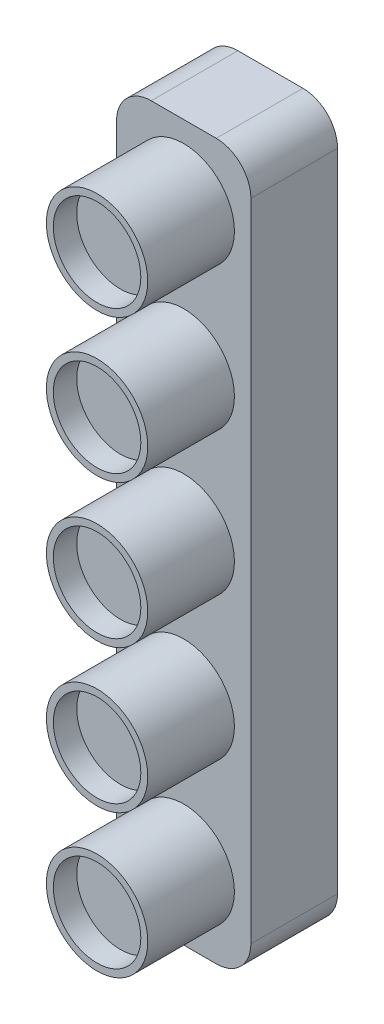
ISO-10303-21;
HEADER;
FILE_DESCRIPTION(('STEP AP214'),'2;1');
FILE_NAME('part.step','',(''),(''),'','','');
FILE_SCHEMA(('AUTOMOTIVE_DESIGN { 1 0 10303 214 1 1 1 1 }'));
ENDSEC;
DATA;
#1=APPLICATION_CONTEXT('core data for automotive mechanical design processes');
#2=APPLICATION_PROTOCOL_DEFINITION('international standard','automotive_design',2000,#1);
#3=PRODUCT_CONTEXT('',#1,'mechanical');
#4=PRODUCT('Part','Part','',(#3));
#5=PRODUCT_RELATED_PRODUCT_CATEGORY('part','',(#4));
#6=PRODUCT_DEFINITION_FORMATION('','',#4);
#7=PRODUCT_DEFINITION_CONTEXT('part definition',#1,'design');
#8=PRODUCT_DEFINITION('design','',#6,#7);
#9=PRODUCT_DEFINITION_SHAPE('','',#8);
#10=(LENGTH_UNIT() NAMED_UNIT(*) SI_UNIT(.MILLI.,.METRE.));
#11=(NAMED_UNIT(*) PLANE_ANGLE_UNIT() SI_UNIT($,.RADIAN.));
#12=(NAMED_UNIT(*) SI_UNIT($,.STERADIAN.) SOLID_ANGLE_UNIT());
#13=UNCERTAINTY_MEASURE_WITH_UNIT(LENGTH_MEASURE(1.E-05),#10,'distance_accuracy_value','');
#14=(GEOMETRIC_REPRESENTATION_CONTEXT(3) GLOBAL_UNCERTAINTY_ASSIGNED_CONTEXT((#13)) GLOBAL_UNIT_ASSIGNED_CONTEXT((#10,
#11,#12)) REPRESENTATION_CONTEXT('',''));
#15=CARTESIAN_POINT('',(0.,0.,0.));
#16=DIRECTION('',(0.,0.,1.));
#17=DIRECTION('',(1.,0.,0.));
#18=AXIS2_PLACEMENT_3D('',#15,#16,#17);
#19=CARTESIAN_POINT('',(-165.,165.,20.));
#20=DIRECTION('',(1.,0.,0.));
#21=DIRECTION('',(0.,0.,-1.));
#22=AXIS2_PLACEMENT_3D('',#19,#20,#21);
#23=PLANE('',#22);
#24=DIRECTION('',(0.,-1.,0.));
#25=VECTOR('',#24,1.);
#26=CARTESIAN_POINT('',(-165.,0.,10.));
#27=LINE('',#26,#25);
#28=CARTESIAN_POINT('',(-165.,161.,10.));
#29=VERTEX_POINT('',#28);
#30=CARTESIAN_POINT('',(-165.,86.5,10.));
#31=VERTEX_POINT('',#30);
#32=EDGE_CURVE('E366',#29,#31,#27,.T.);
#33=ORIENTED_EDGE('',*,*,#32,.F.);
#34=DIRECTION('',(0.,0.,-1.));
#35=VECTOR('',#34,1.);
#36=CARTESIAN_POINT('',(-165.,161.,20.));
#37=LINE('',#36,#35);
#38=CARTESIAN_POINT('',(-165.,161.,0.));
#39=VERTEX_POINT('',#38);
#40=EDGE_CURVE('E463',#29,#39,#37,.T.);
#41=ORIENTED_EDGE('',*,*,#40,.T.);
#42=DIRECTION('',(0.,-1.,0.));
#43=VECTOR('',#42,1.);
#44=CARTESIAN_POINT('',(-165.,165.,0.));
#45=LINE('',#44,#43);
#46=CARTESIAN_POINT('',(-165.,86.5,0.));
#47=VERTEX_POINT('',#46);
#48=EDGE_CURVE('E389',#39,#47,#45,.T.);
#49=ORIENTED_EDGE('',*,*,#48,.T.);
#50=DIRECTION('',(0.,0.,-1.));
#51=VECTOR('',#50,1.);
#52=CARTESIAN_POINT('',(-165.,86.5,20.));
#53=LINE('',#52,#51);
#54=EDGE_CURVE('E460',#47,#31,#53,.F.);
#55=ORIENTED_EDGE('',*,*,#54,.T.);
#56=EDGE_LOOP('',(#33,#41,#49,#55));
#57=FACE_BOUND('',#56,.T.);
#58=ADVANCED_FACE('F116',(#57),#23,.F.);
#59=CARTESIAN_POINT('',(-165.,82.5,20.));
#60=DIRECTION('',(0.,1.,0.));
#61=DIRECTION('',(0.,0.,1.));
#62=AXIS2_PLACEMENT_3D('',#59,#60,#61);
#63=PLANE('',#62);
#64=DIRECTION('',(1.,0.,0.));
#65=VECTOR('',#64,1.);
#66=CARTESIAN_POINT('',(0.,82.5,10.));
#67=LINE('',#66,#65);
#68=CARTESIAN_POINT('',(-161.,82.5,10.));
#69=VERTEX_POINT('',#68);
#70=CARTESIAN_POINT('',(-153.5,82.5,10.));
#71=VERTEX_POINT('',#70);
#72=EDGE_CURVE('E370',#69,#71,#67,.T.);
#73=ORIENTED_EDGE('',*,*,#72,.F.);
#74=DIRECTION('',(0.,0.,-1.));
#75=VECTOR('',#74,1.);
#76=CARTESIAN_POINT('',(-161.,82.5,20.));
#77=LINE('',#76,#75);
#78=CARTESIAN_POINT('',(-161.,82.5,0.));
#79=VERTEX_POINT('',#78);
#80=EDGE_CURVE('E469',#69,#79,#77,.T.);
#81=ORIENTED_EDGE('',*,*,#80,.T.);
#82=DIRECTION('',(1.,0.,0.));
#83=VECTOR('',#82,1.);
#84=CARTESIAN_POINT('',(-165.,82.5,0.));
#85=LINE('',#84,#83);
#86=CARTESIAN_POINT('',(-153.5,82.5,0.));
#87=VERTEX_POINT('',#86);
#88=EDGE_CURVE('E411',#79,#87,#85,.T.);
#89=ORIENTED_EDGE('',*,*,#88,.T.);
#90=DIRECTION('',(0.,0.,-1.));
#91=VECTOR('',#90,1.);
#92=CARTESIAN_POINT('',(-153.5,82.5,20.));
#93=LINE('',#92,#91);
#94=EDGE_CURVE('E140',#87,#71,#93,.F.);
#95=ORIENTED_EDGE('',*,*,#94,.T.);
#96=EDGE_LOOP('',(#73,#81,#89,#95));
#97=FACE_BOUND('',#96,.T.);
#98=ADVANCED_FACE('F519',(#97),#63,.F.);
#99=CARTESIAN_POINT('',(-149.5,165.,20.));
#100=DIRECTION('',(-1.,0.,0.));
#101=DIRECTION('',(0.,0.,1.));
#102=AXIS2_PLACEMENT_3D('',#99,#100,#101);
#103=PLANE('',#102);
#104=DIRECTION('',(0.,1.,0.));
#105=VECTOR('',#104,1.);
#106=CARTESIAN_POINT('',(-149.5,165.,0.));
#107=LINE('',#106,#105);
#108=CARTESIAN_POINT('',(-149.5,86.5,0.));
#109=VERTEX_POINT('',#108);
#110=CARTESIAN_POINT('',(-149.5,161.,0.));
#111=VERTEX_POINT('',#110);
#112=EDGE_CURVE('E414',#109,#111,#107,.T.);
#113=ORIENTED_EDGE('',*,*,#112,.T.);
#114=DIRECTION('',(0.,0.,-1.));
#115=VECTOR('',#114,1.);
#116=CARTESIAN_POINT('',(-149.5,161.,20.));
#117=LINE('',#116,#115);
#118=CARTESIAN_POINT('',(-149.5,161.,10.));
#119=VERTEX_POINT('',#118);
#120=EDGE_CURVE('E445',#111,#119,#117,.F.);
#121=ORIENTED_EDGE('',*,*,#120,.T.);
#122=DIRECTION('',(0.,1.,0.));
#123=VECTOR('',#122,1.);
#124=CARTESIAN_POINT('',(-149.5,0.,10.));
#125=LINE('',#124,#123);
#126=CARTESIAN_POINT('',(-149.5,86.5,10.));
#127=VERTEX_POINT('',#126);
#128=EDGE_CURVE('E373',#127,#119,#125,.T.);
#129=ORIENTED_EDGE('',*,*,#128,.F.);
#130=DIRECTION('',(0.,0.,-1.));
#131=VECTOR('',#130,1.);
#132=CARTESIAN_POINT('',(-149.5,86.5,20.));
#133=LINE('',#132,#131);
#134=EDGE_CURVE('E441',#127,#109,#133,.T.);
#135=ORIENTED_EDGE('',*,*,#134,.T.);
#136=EDGE_LOOP('',(#113,#121,#129,#135));
#137=FACE_BOUND('',#136,.T.);
#138=ADVANCED_FACE('F525',(#137),#103,.F.);
#139=CARTESIAN_POINT('',(-165.,165.,20.));
#140=DIRECTION('',(0.,-1.,0.));
#141=DIRECTION('',(0.,0.,-1.));
#142=AXIS2_PLACEMENT_3D('',#139,#140,#141);
#143=PLANE('',#142);
#144=DIRECTION('',(-1.,0.,0.));
#145=VECTOR('',#144,1.);
#146=CARTESIAN_POINT('',(0.,165.,10.));
#147=LINE('',#146,#145);
#148=CARTESIAN_POINT('',(-153.5,165.,10.));
#149=VERTEX_POINT('',#148);
#150=CARTESIAN_POINT('',(-161.,165.,10.));
#151=VERTEX_POINT('',#150);
#152=EDGE_CURVE('E377',#149,#151,#147,.T.);
#153=ORIENTED_EDGE('',*,*,#152,.F.);
#154=DIRECTION('',(0.,0.,-1.));
#155=VECTOR('',#154,1.);
#156=CARTESIAN_POINT('',(-153.5,165.,20.));
#157=LINE('',#156,#155);
#158=CARTESIAN_POINT('',(-153.5,165.,0.));
#159=VERTEX_POINT('',#158);
#160=EDGE_CURVE('E425',#149,#159,#157,.T.);
#161=ORIENTED_EDGE('',*,*,#160,.T.);
#162=DIRECTION('',(-1.,0.,0.));
#163=VECTOR('',#162,1.);
#164=CARTESIAN_POINT('',(-165.,165.,0.));
#165=LINE('',#164,#163);
#166=CARTESIAN_POINT('',(-161.,165.,0.));
#167=VERTEX_POINT('',#166);
#168=EDGE_CURVE('E418',#159,#167,#165,.T.);
#169=ORIENTED_EDGE('',*,*,#168,.T.);
#170=DIRECTION('',(0.,0.,-1.));
#171=VECTOR('',#170,1.);
#172=CARTESIAN_POINT('',(-161.,165.,20.));
#173=LINE('',#172,#171);
#174=EDGE_CURVE('E422',#167,#151,#173,.F.);
#175=ORIENTED_EDGE('',*,*,#174,.T.);
#176=EDGE_LOOP('',(#153,#161,#169,#175));
#177=FACE_BOUND('',#176,.T.);
#178=ADVANCED_FACE('F513',(#177),#143,.F.);
#179=CARTESIAN_POINT('',(0.,0.,0.));
#180=DIRECTION('',(0.,0.,1.));
#181=DIRECTION('',(1.,0.,0.));
#182=AXIS2_PLACEMENT_3D('',#179,#180,#181);
#183=PLANE('',#182);
#184=DIRECTION('',(1.,0.,0.));
#185=VECTOR('',#184,1.);
#186=CARTESIAN_POINT('',(-161.,163.,0.));
#187=LINE('',#186,#185);
#188=CARTESIAN_POINT('',(-161.,163.,0.));
#189=VERTEX_POINT('',#188);
#190=CARTESIAN_POINT('',(-153.5,163.,0.));
#191=VERTEX_POINT('',#190);
#192=EDGE_CURVE('E284',#189,#191,#187,.T.);
#193=ORIENTED_EDGE('',*,*,#192,.F.);
#194=CARTESIAN_POINT('',(-161.,161.,0.));
#195=DIRECTION('',(0.,0.,-1.));
#196=DIRECTION('',(-1.,0.,0.));
#197=AXIS2_PLACEMENT_3D('',#194,#195,#196);
#198=CIRCLE('',#197,2.);
#199=CARTESIAN_POINT('',(-163.,161.,0.));
#200=VERTEX_POINT('',#199);
#201=EDGE_CURVE('E132',#200,#189,#198,.T.);
#202=ORIENTED_EDGE('',*,*,#201,.F.);
#203=DIRECTION('',(0.,1.,0.));
#204=VECTOR('',#203,1.);
#205=CARTESIAN_POINT('',(-163.,86.5,0.));
#206=LINE('',#205,#204);
#207=CARTESIAN_POINT('',(-163.,86.5,0.));
#208=VERTEX_POINT('',#207);
#209=EDGE_CURVE('E256',#208,#200,#206,.T.);
#210=ORIENTED_EDGE('',*,*,#209,.F.);
#211=CARTESIAN_POINT('',(-161.,86.5,0.));
#212=DIRECTION('',(0.,0.,-1.));
#213=DIRECTION('',(-1.,0.,0.));
#214=AXIS2_PLACEMENT_3D('',#211,#212,#213);
#215=CIRCLE('',#214,2.);
#216=CARTESIAN_POINT('',(-161.,84.5,0.));
#217=VERTEX_POINT('',#216);
#218=EDGE_CURVE('E260',#217,#208,#215,.T.);
#219=ORIENTED_EDGE('',*,*,#218,.F.);
#220=DIRECTION('',(-1.,0.,0.));
#221=VECTOR('',#220,1.);
#222=CARTESIAN_POINT('',(-153.5,84.5,0.));
#223=LINE('',#222,#221);
#224=CARTESIAN_POINT('',(-153.5,84.5,0.));
#225=VERTEX_POINT('',#224);
#226=EDGE_CURVE('E299',#225,#217,#223,.T.);
#227=ORIENTED_EDGE('',*,*,#226,.F.);
#228=CARTESIAN_POINT('',(-153.5,86.5,0.));
#229=DIRECTION('',(0.,0.,-1.));
#230=DIRECTION('',(-1.,0.,0.));
#231=AXIS2_PLACEMENT_3D('',#228,#229,#230);
#232=CIRCLE('',#231,2.);
#233=CARTESIAN_POINT('',(-151.5,86.5,0.));
#234=VERTEX_POINT('',#233);
#235=EDGE_CURVE('E295',#234,#225,#232,.T.);
#236=ORIENTED_EDGE('',*,*,#235,.F.);
#237=DIRECTION('',(0.,-1.,0.));
#238=VECTOR('',#237,1.);
#239=CARTESIAN_POINT('',(-151.5,161.,0.));
#240=LINE('',#239,#238);
#241=CARTESIAN_POINT('',(-151.5,161.,0.));
#242=VERTEX_POINT('',#241);
#243=EDGE_CURVE('E291',#242,#234,#240,.T.);
#244=ORIENTED_EDGE('',*,*,#243,.F.);
#245=CARTESIAN_POINT('',(-153.5,161.,0.));
#246=DIRECTION('',(0.,0.,-1.));
#247=DIRECTION('',(-1.,0.,0.));
#248=AXIS2_PLACEMENT_3D('',#245,#246,#247);
#249=CIRCLE('',#248,2.);
#250=EDGE_CURVE('E287',#191,#242,#249,.T.);
#251=ORIENTED_EDGE('',*,*,#250,.F.);
#252=EDGE_LOOP('',(#193,#202,#210,#219,#227,#236,#244,#251));
#253=FACE_BOUND('',#252,.T.);
#254=ORIENTED_EDGE('',*,*,#168,.F.);
#255=CARTESIAN_POINT('',(-153.5,161.,0.));
#256=DIRECTION('',(0.,0.,1.));
#257=DIRECTION('',(1.,0.,0.));
#258=AXIS2_PLACEMENT_3D('',#255,#256,#257);
#259=CIRCLE('',#258,4.);
#260=EDGE_CURVE('E438',#159,#111,#259,.F.);
#261=ORIENTED_EDGE('',*,*,#260,.T.);
#262=ORIENTED_EDGE('',*,*,#112,.F.);
#263=CARTESIAN_POINT('',(-153.5,86.5,0.));
#264=DIRECTION('',(0.,0.,1.));
#265=DIRECTION('',(1.,0.,0.));
#266=AXIS2_PLACEMENT_3D('',#263,#264,#265);
#267=CIRCLE('',#266,4.);
#268=EDGE_CURVE('E429',#109,#87,#267,.F.);
#269=ORIENTED_EDGE('',*,*,#268,.T.);
#270=ORIENTED_EDGE('',*,*,#88,.F.);
#271=CARTESIAN_POINT('',(-161.,86.5,0.));
#272=DIRECTION('',(0.,0.,1.));
#273=DIRECTION('',(1.,0.,0.));
#274=AXIS2_PLACEMENT_3D('',#271,#272,#273);
#275=CIRCLE('',#274,4.);
#276=EDGE_CURVE('E432',#79,#47,#275,.F.);
#277=ORIENTED_EDGE('',*,*,#276,.T.);
#278=ORIENTED_EDGE('',*,*,#48,.F.);
#279=CARTESIAN_POINT('',(-161.,161.,0.));
#280=DIRECTION('',(0.,0.,1.));
#281=DIRECTION('',(1.,0.,0.));
#282=AXIS2_PLACEMENT_3D('',#279,#280,#281);
#283=CIRCLE('',#282,4.);
#284=EDGE_CURVE('E435',#39,#167,#283,.F.);
#285=ORIENTED_EDGE('',*,*,#284,.T.);
#286=EDGE_LOOP('',(#254,#261,#262,#269,#270,#277,#278,#285));
#287=FACE_BOUND('',#286,.T.);
#288=ADVANCED_FACE('F503',(#253,#287),#183,.F.);
#289=CARTESIAN_POINT('',(-157.25,107.25,10.));
#290=DIRECTION('',(0.,0.,1.));
#291=DIRECTION('',(1.,0.,0.));
#292=AXIS2_PLACEMENT_3D('',#289,#290,#291);
#293=CYLINDRICAL_SURFACE('',#292,5.85);
#294=CARTESIAN_POINT('',(-157.25,107.25,10.));
#295=DIRECTION('',(0.,0.,1.));
#296=DIRECTION('',(1.,0.,0.));
#297=AXIS2_PLACEMENT_3D('',#294,#295,#296);
#298=CIRCLE('',#297,5.85);
#299=CARTESIAN_POINT('',(-151.4,107.25,10.));
#300=VERTEX_POINT('',#299);
#301=EDGE_CURVE('E381',#300,#300,#298,.F.);
#302=ORIENTED_EDGE('',*,*,#301,.F.);
#303=EDGE_LOOP('',(#302));
#304=FACE_BOUND('',#303,.T.);
#305=CARTESIAN_POINT('',(-157.25,107.25,20.));
#306=DIRECTION('',(0.,0.,1.));
#307=DIRECTION('',(1.,0.,0.));
#308=AXIS2_PLACEMENT_3D('',#305,#306,#307);
#309=CIRCLE('',#308,5.85);
#310=CARTESIAN_POINT('',(-151.4,107.25,20.));
#311=VERTEX_POINT('',#310);
#312=EDGE_CURVE('E401',#311,#311,#309,.F.);
#313=ORIENTED_EDGE('',*,*,#312,.T.);
#314=EDGE_LOOP('',(#313));
#315=FACE_BOUND('',#314,.T.);
#316=ADVANCED_FACE('F500',(#304,#315),#293,.T.);
#317=CARTESIAN_POINT('',(-157.25,140.25,10.));
#318=DIRECTION('',(0.,0.,1.));
#319=DIRECTION('',(1.,0.,0.));
#320=AXIS2_PLACEMENT_3D('',#317,#318,#319);
#321=CYLINDRICAL_SURFACE('',#320,5.85);
#322=CARTESIAN_POINT('',(-157.25,140.25,10.));
#323=DIRECTION('',(0.,0.,1.));
#324=DIRECTION('',(1.,0.,0.));
#325=AXIS2_PLACEMENT_3D('',#322,#323,#324);
#326=CIRCLE('',#325,5.85);
#327=CARTESIAN_POINT('',(-151.4,140.25,10.));
#328=VERTEX_POINT('',#327);
#329=EDGE_CURVE('E362',#328,#328,#326,.T.);
#330=ORIENTED_EDGE('',*,*,#329,.T.);
#331=EDGE_LOOP('',(#330));
#332=FACE_BOUND('',#331,.T.);
#333=CARTESIAN_POINT('',(-157.25,140.25,20.));
#334=DIRECTION('',(0.,0.,1.));
#335=DIRECTION('',(1.,0.,0.));
#336=AXIS2_PLACEMENT_3D('',#333,#334,#335);
#337=CIRCLE('',#336,5.85);
#338=CARTESIAN_POINT('',(-151.4,140.25,20.));
#339=VERTEX_POINT('',#338);
#340=EDGE_CURVE('E397',#339,#339,#337,.T.);
#341=ORIENTED_EDGE('',*,*,#340,.F.);
#342=EDGE_LOOP('',(#341));
#343=FACE_BOUND('',#342,.T.);
#344=ADVANCED_FACE('F502',(#332,#343),#321,.T.);
#345=CARTESIAN_POINT('',(-157.25,156.75,10.));
#346=DIRECTION('',(0.,0.,1.));
#347=DIRECTION('',(1.,0.,0.));
#348=AXIS2_PLACEMENT_3D('',#345,#346,#347);
#349=CYLINDRICAL_SURFACE('',#348,5.85);
#350=CARTESIAN_POINT('',(-157.25,156.75,10.));
#351=DIRECTION('',(0.,0.,1.));
#352=DIRECTION('',(1.,0.,0.));
#353=AXIS2_PLACEMENT_3D('',#350,#351,#352);
#354=CIRCLE('',#353,5.85);
#355=CARTESIAN_POINT('',(-151.4,156.75,10.));
#356=VERTEX_POINT('',#355);
#357=EDGE_CURVE('E357',#356,#356,#354,.T.);
#358=ORIENTED_EDGE('',*,*,#357,.T.);
#359=EDGE_LOOP('',(#358));
#360=FACE_BOUND('',#359,.T.);
#361=CARTESIAN_POINT('',(-157.25,156.75,20.));
#362=DIRECTION('',(0.,0.,1.));
#363=DIRECTION('',(1.,0.,0.));
#364=AXIS2_PLACEMENT_3D('',#361,#362,#363);
#365=CIRCLE('',#364,5.85);
#366=CARTESIAN_POINT('',(-151.4,156.75,20.));
#367=VERTEX_POINT('',#366);
#368=EDGE_CURVE('E393',#367,#367,#365,.T.);
#369=ORIENTED_EDGE('',*,*,#368,.F.);
#370=EDGE_LOOP('',(#369));
#371=FACE_BOUND('',#370,.T.);
#372=ADVANCED_FACE('F510',(#360,#371),#349,.T.);
#373=CARTESIAN_POINT('',(-157.25,123.75,10.));
#374=DIRECTION('',(0.,0.,1.));
#375=DIRECTION('',(1.,0.,0.));
#376=AXIS2_PLACEMENT_3D('',#373,#374,#375);
#377=CYLINDRICAL_SURFACE('',#376,5.85);
#378=CARTESIAN_POINT('',(-157.25,123.75,10.));
#379=DIRECTION('',(0.,0.,1.));
#380=DIRECTION('',(1.,0.,0.));
#381=AXIS2_PLACEMENT_3D('',#378,#379,#380);
#382=CIRCLE('',#381,5.85);
#383=CARTESIAN_POINT('',(-151.4,123.75,10.));
#384=VERTEX_POINT('',#383);
#385=EDGE_CURVE('E353',#384,#384,#382,.T.);
#386=ORIENTED_EDGE('',*,*,#385,.T.);
#387=EDGE_LOOP('',(#386));
#388=FACE_BOUND('',#387,.T.);
#389=CARTESIAN_POINT('',(-157.25,123.75,20.));
#390=DIRECTION('',(0.,0.,1.));
#391=DIRECTION('',(1.,0.,0.));
#392=AXIS2_PLACEMENT_3D('',#389,#390,#391);
#393=CIRCLE('',#392,5.85);
#394=CARTESIAN_POINT('',(-151.4,123.75,20.));
#395=VERTEX_POINT('',#394);
#396=EDGE_CURVE('E335',#395,#395,#393,.T.);
#397=ORIENTED_EDGE('',*,*,#396,.F.);
#398=EDGE_LOOP('',(#397));
#399=FACE_BOUND('',#398,.T.);
#400=ADVANCED_FACE('F578',(#388,#399),#377,.T.);
#401=CARTESIAN_POINT('',(-157.25,90.75,10.));
#402=DIRECTION('',(0.,0.,1.));
#403=DIRECTION('',(1.,0.,0.));
#404=AXIS2_PLACEMENT_3D('',#401,#402,#403);
#405=CYLINDRICAL_SURFACE('',#404,5.85);
#406=CARTESIAN_POINT('',(-157.25,90.75,10.));
#407=DIRECTION('',(0.,0.,1.));
#408=DIRECTION('',(1.,0.,0.));
#409=AXIS2_PLACEMENT_3D('',#406,#407,#408);
#410=CIRCLE('',#409,5.85);
#411=CARTESIAN_POINT('',(-151.4,90.75,10.));
#412=VERTEX_POINT('',#411);
#413=EDGE_CURVE('E385',#412,#412,#410,.F.);
#414=ORIENTED_EDGE('',*,*,#413,.F.);
#415=EDGE_LOOP('',(#414));
#416=FACE_BOUND('',#415,.T.);
#417=CARTESIAN_POINT('',(-157.25,90.75,20.));
#418=DIRECTION('',(0.,0.,1.));
#419=DIRECTION('',(1.,0.,0.));
#420=AXIS2_PLACEMENT_3D('',#417,#418,#419);
#421=CIRCLE('',#420,5.85);
#422=CARTESIAN_POINT('',(-151.4,90.75,20.));
#423=VERTEX_POINT('',#422);
#424=EDGE_CURVE('E358',#423,#423,#421,.F.);
#425=ORIENTED_EDGE('',*,*,#424,.T.);
#426=EDGE_LOOP('',(#425));
#427=FACE_BOUND('',#426,.T.);
#428=ADVANCED_FACE('F581',(#416,#427),#405,.T.);
#429=CARTESIAN_POINT('',(0.,0.,10.));
#430=DIRECTION('',(0.,0.,1.));
#431=DIRECTION('',(1.,0.,0.));
#432=AXIS2_PLACEMENT_3D('',#429,#430,#431);
#433=PLANE('',#432);
#434=ORIENTED_EDGE('',*,*,#385,.F.);
#435=EDGE_LOOP('',(#434));
#436=FACE_BOUND('',#435,.T.);
#437=ORIENTED_EDGE('',*,*,#357,.F.);
#438=EDGE_LOOP('',(#437));
#439=FACE_BOUND('',#438,.T.);
#440=ORIENTED_EDGE('',*,*,#329,.F.);
#441=EDGE_LOOP('',(#440));
#442=FACE_BOUND('',#441,.T.);
#443=ORIENTED_EDGE('',*,*,#128,.T.);
#444=CARTESIAN_POINT('',(-153.5,161.,10.));
#445=DIRECTION('',(0.,0.,1.));
#446=DIRECTION('',(1.,0.,0.));
#447=AXIS2_PLACEMENT_3D('',#444,#445,#446);
#448=CIRCLE('',#447,4.);
#449=EDGE_CURVE('E457',#119,#149,#448,.T.);
#450=ORIENTED_EDGE('',*,*,#449,.T.);
#451=ORIENTED_EDGE('',*,*,#152,.T.);
#452=CARTESIAN_POINT('',(-161.,161.,10.));
#453=DIRECTION('',(0.,0.,1.));
#454=DIRECTION('',(1.,0.,0.));
#455=AXIS2_PLACEMENT_3D('',#452,#453,#454);
#456=CIRCLE('',#455,4.);
#457=EDGE_CURVE('E454',#151,#29,#456,.T.);
#458=ORIENTED_EDGE('',*,*,#457,.T.);
#459=ORIENTED_EDGE('',*,*,#32,.T.);
#460=CARTESIAN_POINT('',(-161.,86.5,10.));
#461=DIRECTION('',(0.,0.,1.));
#462=DIRECTION('',(1.,0.,0.));
#463=AXIS2_PLACEMENT_3D('',#460,#461,#462);
#464=CIRCLE('',#463,4.);
#465=EDGE_CURVE('E451',#31,#69,#464,.T.);
#466=ORIENTED_EDGE('',*,*,#465,.T.);
#467=ORIENTED_EDGE('',*,*,#72,.T.);
#468=CARTESIAN_POINT('',(-153.5,86.5,10.));
#469=DIRECTION('',(0.,0.,1.));
#470=DIRECTION('',(1.,0.,0.));
#471=AXIS2_PLACEMENT_3D('',#468,#469,#470);
#472=CIRCLE('',#471,4.);
#473=EDGE_CURVE('E448',#71,#127,#472,.T.);
#474=ORIENTED_EDGE('',*,*,#473,.T.);
#475=EDGE_LOOP('',(#443,#450,#451,#458,#459,#466,#467,#474));
#476=FACE_BOUND('',#475,.T.);
#477=ORIENTED_EDGE('',*,*,#301,.T.);
#478=EDGE_LOOP('',(#477));
#479=FACE_BOUND('',#478,.T.);
#480=ORIENTED_EDGE('',*,*,#413,.T.);
#481=EDGE_LOOP('',(#480));
#482=FACE_BOUND('',#481,.T.);
#483=ADVANCED_FACE('F550',(#436,#439,#442,#476,#479,#482),#433,.T.);
#484=CARTESIAN_POINT('',(0.,0.,20.));
#485=DIRECTION('',(0.,0.,1.));
#486=DIRECTION('',(1.,0.,0.));
#487=AXIS2_PLACEMENT_3D('',#484,#485,#486);
#488=PLANE('',#487);
#489=ORIENTED_EDGE('',*,*,#396,.T.);
#490=EDGE_LOOP('',(#489));
#491=FACE_BOUND('',#490,.T.);
#492=CARTESIAN_POINT('',(-157.25,123.75,20.));
#493=DIRECTION('',(0.,0.,1.));
#494=DIRECTION('',(1.,0.,0.));
#495=AXIS2_PLACEMENT_3D('',#492,#493,#494);
#496=CIRCLE('',#495,5.04999999999999);
#497=CARTESIAN_POINT('',(-152.2,123.75,20.));
#498=VERTEX_POINT('',#497);
#499=EDGE_CURVE('E340',#498,#498,#496,.T.);
#500=ORIENTED_EDGE('',*,*,#499,.F.);
#501=EDGE_LOOP('',(#500));
#502=FACE_BOUND('',#501,.T.);
#503=ADVANCED_FACE('F497',(#491,#502),#488,.T.);
#504=ORIENTED_EDGE('',*,*,#368,.T.);
#505=EDGE_LOOP('',(#504));
#506=FACE_BOUND('',#505,.T.);
#507=CARTESIAN_POINT('',(-157.25,156.75,20.));
#508=DIRECTION('',(0.,0.,1.));
#509=DIRECTION('',(1.,0.,0.));
#510=AXIS2_PLACEMENT_3D('',#507,#508,#509);
#511=CIRCLE('',#510,5.04999999999999);
#512=CARTESIAN_POINT('',(-152.2,156.75,20.));
#513=VERTEX_POINT('',#512);
#514=EDGE_CURVE('E348',#513,#513,#511,.T.);
#515=ORIENTED_EDGE('',*,*,#514,.F.);
#516=EDGE_LOOP('',(#515));
#517=FACE_BOUND('',#516,.T.);
#518=ADVANCED_FACE('F574',(#506,#517),#488,.T.);
#519=ORIENTED_EDGE('',*,*,#340,.T.);
#520=EDGE_LOOP('',(#519));
#521=FACE_BOUND('',#520,.T.);
#522=CARTESIAN_POINT('',(-157.25,140.25,20.));
#523=DIRECTION('',(0.,0.,1.));
#524=DIRECTION('',(1.,0.,0.));
#525=AXIS2_PLACEMENT_3D('',#522,#523,#524);
#526=CIRCLE('',#525,5.04999999999999);
#527=CARTESIAN_POINT('',(-152.2,140.25,20.));
#528=VERTEX_POINT('',#527);
#529=EDGE_CURVE('E344',#528,#528,#526,.T.);
#530=ORIENTED_EDGE('',*,*,#529,.F.);
#531=EDGE_LOOP('',(#530));
#532=FACE_BOUND('',#531,.T.);
#533=ADVANCED_FACE('F494',(#521,#532),#488,.T.);
#534=CARTESIAN_POINT('',(-157.25,107.25,20.));
#535=DIRECTION('',(0.,0.,1.));
#536=DIRECTION('',(1.,0.,0.));
#537=AXIS2_PLACEMENT_3D('',#534,#535,#536);
#538=CIRCLE('',#537,5.04999999999999);
#539=CARTESIAN_POINT('',(-152.2,107.25,20.));
#540=VERTEX_POINT('',#539);
#541=EDGE_CURVE('E336',#540,#540,#538,.F.);
#542=ORIENTED_EDGE('',*,*,#541,.T.);
#543=EDGE_LOOP('',(#542));
#544=FACE_BOUND('',#543,.T.);
#545=ORIENTED_EDGE('',*,*,#312,.F.);
#546=EDGE_LOOP('',(#545));
#547=FACE_BOUND('',#546,.T.);
#548=ADVANCED_FACE('F488',(#544,#547),#488,.T.);
#549=CARTESIAN_POINT('',(-157.25,107.25,10.));
#550=DIRECTION('',(0.,0.,1.));
#551=DIRECTION('',(1.,0.,0.));
#552=AXIS2_PLACEMENT_3D('',#549,#550,#551);
#553=CYLINDRICAL_SURFACE('',#552,5.04999999999999);
#554=CARTESIAN_POINT('',(-157.25,107.25,17.3));
#555=DIRECTION('',(0.,0.,1.));
#556=DIRECTION('',(1.,0.,0.));
#557=AXIS2_PLACEMENT_3D('',#554,#555,#556);
#558=CIRCLE('',#557,5.04999999999999);
#559=CARTESIAN_POINT('',(-152.2,107.25,17.3));
#560=VERTEX_POINT('',#559);
#561=EDGE_CURVE('E125',#560,#560,#558,.T.);
#562=ORIENTED_EDGE('',*,*,#561,.F.);
#563=EDGE_LOOP('',(#562));
#564=FACE_BOUND('',#563,.T.);
#565=ORIENTED_EDGE('',*,*,#541,.F.);
#566=EDGE_LOOP('',(#565));
#567=FACE_BOUND('',#566,.T.);
#568=ADVANCED_FACE('F484',(#564,#567),#553,.F.);
#569=CARTESIAN_POINT('',(-157.25,123.75,10.));
#570=DIRECTION('',(0.,0.,1.));
#571=DIRECTION('',(1.,0.,0.));
#572=AXIS2_PLACEMENT_3D('',#569,#570,#571);
#573=CYLINDRICAL_SURFACE('',#572,5.04999999999999);
#574=CARTESIAN_POINT('',(-157.25,123.75,17.3));
#575=DIRECTION('',(0.,0.,1.));
#576=DIRECTION('',(1.,0.,0.));
#577=AXIS2_PLACEMENT_3D('',#574,#575,#576);
#578=CIRCLE('',#577,5.04999999999999);
#579=CARTESIAN_POINT('',(-152.2,123.75,17.3));
#580=VERTEX_POINT('',#579);
#581=EDGE_CURVE('E309',#580,#580,#578,.T.);
#582=ORIENTED_EDGE('',*,*,#581,.F.);
#583=EDGE_LOOP('',(#582));
#584=FACE_BOUND('',#583,.T.);
#585=ORIENTED_EDGE('',*,*,#499,.T.);
#586=EDGE_LOOP('',(#585));
#587=FACE_BOUND('',#586,.T.);
#588=ADVANCED_FACE('F487',(#584,#587),#573,.F.);
#589=CARTESIAN_POINT('',(-157.25,140.25,10.));
#590=DIRECTION('',(0.,0.,1.));
#591=DIRECTION('',(1.,0.,0.));
#592=AXIS2_PLACEMENT_3D('',#589,#590,#591);
#593=CYLINDRICAL_SURFACE('',#592,5.04999999999999);
#594=CARTESIAN_POINT('',(-157.25,140.25,17.3));
#595=DIRECTION('',(0.,0.,1.));
#596=DIRECTION('',(1.,0.,0.));
#597=AXIS2_PLACEMENT_3D('',#594,#595,#596);
#598=CIRCLE('',#597,5.04999999999999);
#599=CARTESIAN_POINT('',(-152.2,140.25,17.3));
#600=VERTEX_POINT('',#599);
#601=EDGE_CURVE('E330',#600,#600,#598,.F.);
#602=ORIENTED_EDGE('',*,*,#601,.T.);
#603=EDGE_LOOP('',(#602));
#604=FACE_BOUND('',#603,.T.);
#605=ORIENTED_EDGE('',*,*,#529,.T.);
#606=EDGE_LOOP('',(#605));
#607=FACE_BOUND('',#606,.T.);
#608=ADVANCED_FACE('F595',(#604,#607),#593,.F.);
#609=CARTESIAN_POINT('',(-157.25,156.75,10.));
#610=DIRECTION('',(0.,0.,1.));
#611=DIRECTION('',(1.,0.,0.));
#612=AXIS2_PLACEMENT_3D('',#609,#610,#611);
#613=CYLINDRICAL_SURFACE('',#612,5.04999999999999);
#614=CARTESIAN_POINT('',(-157.25,156.75,17.3));
#615=DIRECTION('',(0.,0.,1.));
#616=DIRECTION('',(1.,0.,0.));
#617=AXIS2_PLACEMENT_3D('',#614,#615,#616);
#618=CIRCLE('',#617,5.04999999999999);
#619=CARTESIAN_POINT('',(-152.2,156.75,17.3));
#620=VERTEX_POINT('',#619);
#621=EDGE_CURVE('E352',#620,#620,#618,.F.);
#622=ORIENTED_EDGE('',*,*,#621,.T.);
#623=EDGE_LOOP('',(#622));
#624=FACE_BOUND('',#623,.T.);
#625=ORIENTED_EDGE('',*,*,#514,.T.);
#626=EDGE_LOOP('',(#625));
#627=FACE_BOUND('',#626,.T.);
#628=ADVANCED_FACE('F593',(#624,#627),#613,.F.);
#629=CARTESIAN_POINT('',(-157.25,90.75,20.));
#630=DIRECTION('',(0.,0.,1.));
#631=DIRECTION('',(1.,0.,0.));
#632=AXIS2_PLACEMENT_3D('',#629,#630,#631);
#633=CIRCLE('',#632,5.04999999999999);
#634=CARTESIAN_POINT('',(-152.2,90.75,20.));
#635=VERTEX_POINT('',#634);
#636=EDGE_CURVE('E331',#635,#635,#633,.F.);
#637=ORIENTED_EDGE('',*,*,#636,.T.);
#638=EDGE_LOOP('',(#637));
#639=FACE_BOUND('',#638,.T.);
#640=ORIENTED_EDGE('',*,*,#424,.F.);
#641=EDGE_LOOP('',(#640));
#642=FACE_BOUND('',#641,.T.);
#643=ADVANCED_FACE('F496',(#639,#642),#488,.T.);
#644=CARTESIAN_POINT('',(-157.25,90.75,10.));
#645=DIRECTION('',(0.,0.,1.));
#646=DIRECTION('',(1.,0.,0.));
#647=AXIS2_PLACEMENT_3D('',#644,#645,#646);
#648=CYLINDRICAL_SURFACE('',#647,5.04999999999999);
#649=CARTESIAN_POINT('',(-157.25,90.75,17.3));
#650=DIRECTION('',(0.,0.,1.));
#651=DIRECTION('',(1.,0.,0.));
#652=AXIS2_PLACEMENT_3D('',#649,#650,#651);
#653=CIRCLE('',#652,5.04999999999999);
#654=CARTESIAN_POINT('',(-152.2,90.75,17.3));
#655=VERTEX_POINT('',#654);
#656=EDGE_CURVE('E12',#655,#655,#653,.T.);
#657=ORIENTED_EDGE('',*,*,#656,.F.);
#658=EDGE_LOOP('',(#657));
#659=FACE_BOUND('',#658,.T.);
#660=ORIENTED_EDGE('',*,*,#636,.F.);
#661=EDGE_LOOP('',(#660));
#662=FACE_BOUND('',#661,.T.);
#663=ADVANCED_FACE('F534',(#659,#662),#648,.F.);
#664=CARTESIAN_POINT('',(-153.5,161.,20.));
#665=DIRECTION('',(0.,0.,-1.));
#666=DIRECTION('',(-1.,0.,0.));
#667=AXIS2_PLACEMENT_3D('',#664,#665,#666);
#668=CYLINDRICAL_SURFACE('',#667,4.);
#669=ORIENTED_EDGE('',*,*,#449,.F.);
#670=ORIENTED_EDGE('',*,*,#120,.F.);
#671=ORIENTED_EDGE('',*,*,#260,.F.);
#672=ORIENTED_EDGE('',*,*,#160,.F.);
#673=EDGE_LOOP('',(#669,#670,#671,#672));
#674=FACE_BOUND('',#673,.T.);
#675=ADVANCED_FACE('F530',(#674),#668,.T.);
#676=CARTESIAN_POINT('',(-161.,161.,20.));
#677=DIRECTION('',(0.,0.,-1.));
#678=DIRECTION('',(-1.,0.,0.));
#679=AXIS2_PLACEMENT_3D('',#676,#677,#678);
#680=CYLINDRICAL_SURFACE('',#679,4.);
#681=ORIENTED_EDGE('',*,*,#457,.F.);
#682=ORIENTED_EDGE('',*,*,#174,.F.);
#683=ORIENTED_EDGE('',*,*,#284,.F.);
#684=ORIENTED_EDGE('',*,*,#40,.F.);
#685=EDGE_LOOP('',(#681,#682,#683,#684));
#686=FACE_BOUND('',#685,.T.);
#687=ADVANCED_FACE('F533',(#686),#680,.T.);
#688=CARTESIAN_POINT('',(-161.,86.5,20.));
#689=DIRECTION('',(0.,0.,-1.));
#690=DIRECTION('',(-1.,0.,0.));
#691=AXIS2_PLACEMENT_3D('',#688,#689,#690);
#692=CYLINDRICAL_SURFACE('',#691,4.);
#693=ORIENTED_EDGE('',*,*,#465,.F.);
#694=ORIENTED_EDGE('',*,*,#54,.F.);
#695=ORIENTED_EDGE('',*,*,#276,.F.);
#696=ORIENTED_EDGE('',*,*,#80,.F.);
#697=EDGE_LOOP('',(#693,#694,#695,#696));
#698=FACE_BOUND('',#697,.T.);
#699=ADVANCED_FACE('F537',(#698),#692,.T.);
#700=CARTESIAN_POINT('',(-153.5,86.5,20.));
#701=DIRECTION('',(0.,0.,-1.));
#702=DIRECTION('',(-1.,0.,0.));
#703=AXIS2_PLACEMENT_3D('',#700,#701,#702);
#704=CYLINDRICAL_SURFACE('',#703,4.);
#705=ORIENTED_EDGE('',*,*,#473,.F.);
#706=ORIENTED_EDGE('',*,*,#94,.F.);
#707=ORIENTED_EDGE('',*,*,#268,.F.);
#708=ORIENTED_EDGE('',*,*,#134,.F.);
#709=EDGE_LOOP('',(#705,#706,#707,#708));
#710=FACE_BOUND('',#709,.T.);
#711=ADVANCED_FACE('F118',(#710),#704,.T.);
#712=CARTESIAN_POINT('',(-157.25,156.75,17.3));
#713=DIRECTION('',(0.,0.,1.));
#714=DIRECTION('',(1.,0.,0.));
#715=AXIS2_PLACEMENT_3D('',#712,#713,#714);
#716=PLANE('',#715);
#717=ORIENTED_EDGE('',*,*,#621,.F.);
#718=EDGE_LOOP('',(#717));
#719=FACE_BOUND('',#718,.T.);
#720=ADVANCED_FACE('F544',(#719),#716,.T.);
#721=CARTESIAN_POINT('',(-157.25,140.25,17.3));
#722=DIRECTION('',(0.,0.,1.));
#723=DIRECTION('',(1.,0.,0.));
#724=AXIS2_PLACEMENT_3D('',#721,#722,#723);
#725=PLANE('',#724);
#726=ORIENTED_EDGE('',*,*,#601,.F.);
#727=EDGE_LOOP('',(#726));
#728=FACE_BOUND('',#727,.T.);
#729=ADVANCED_FACE('F684',(#728),#725,.T.);
#730=CARTESIAN_POINT('',(-157.25,123.75,17.3));
#731=DIRECTION('',(0.,0.,1.));
#732=DIRECTION('',(1.,0.,0.));
#733=AXIS2_PLACEMENT_3D('',#730,#731,#732);
#734=PLANE('',#733);
#735=ORIENTED_EDGE('',*,*,#581,.T.);
#736=EDGE_LOOP('',(#735));
#737=FACE_BOUND('',#736,.T.);
#738=ADVANCED_FACE('F695',(#737),#734,.T.);
#739=CARTESIAN_POINT('',(-157.25,107.25,17.3));
#740=DIRECTION('',(0.,0.,1.));
#741=DIRECTION('',(1.,0.,0.));
#742=AXIS2_PLACEMENT_3D('',#739,#740,#741);
#743=PLANE('',#742);
#744=ORIENTED_EDGE('',*,*,#561,.T.);
#745=EDGE_LOOP('',(#744));
#746=FACE_BOUND('',#745,.T.);
#747=ADVANCED_FACE('F482',(#746),#743,.T.);
#748=CARTESIAN_POINT('',(-157.25,90.75,17.3));
#749=DIRECTION('',(0.,0.,1.));
#750=DIRECTION('',(1.,0.,0.));
#751=AXIS2_PLACEMENT_3D('',#748,#749,#750);
#752=PLANE('',#751);
#753=ORIENTED_EDGE('',*,*,#656,.T.);
#754=EDGE_LOOP('',(#753));
#755=FACE_BOUND('',#754,.T.);
#756=ADVANCED_FACE('F714',(#755),#752,.T.);
#757=CARTESIAN_POINT('',(-161.,161.,9.));
#758=DIRECTION('',(0.,0.,-1.));
#759=DIRECTION('',(-1.,0.,0.));
#760=AXIS2_PLACEMENT_3D('',#757,#758,#759);
#761=CYLINDRICAL_SURFACE('',#760,2.);
#762=ORIENTED_EDGE('',*,*,#201,.T.);
#763=DIRECTION('',(0.,0.,-1.));
#764=VECTOR('',#763,1.);
#765=CARTESIAN_POINT('',(-161.,163.,9.));
#766=LINE('',#765,#764);
#767=CARTESIAN_POINT('',(-161.,163.,9.));
#768=VERTEX_POINT('',#767);
#769=EDGE_CURVE('E230',#768,#189,#766,.T.);
#770=ORIENTED_EDGE('',*,*,#769,.F.);
#771=CARTESIAN_POINT('',(-161.,161.,9.));
#772=DIRECTION('',(0.,0.,-1.));
#773=DIRECTION('',(-1.,0.,0.));
#774=AXIS2_PLACEMENT_3D('',#771,#772,#773);
#775=CIRCLE('',#774,2.);
#776=CARTESIAN_POINT('',(-163.,161.,9.));
#777=VERTEX_POINT('',#776);
#778=EDGE_CURVE('E234',#777,#768,#775,.T.);
#779=ORIENTED_EDGE('',*,*,#778,.F.);
#780=DIRECTION('',(0.,0.,-1.));
#781=VECTOR('',#780,1.);
#782=CARTESIAN_POINT('',(-163.,161.,9.));
#783=LINE('',#782,#781);
#784=EDGE_CURVE('E306',#777,#200,#783,.T.);
#785=ORIENTED_EDGE('',*,*,#784,.T.);
#786=EDGE_LOOP('',(#762,#770,#779,#785));
#787=FACE_BOUND('',#786,.T.);
#788=ADVANCED_FACE('F232',(#787),#761,.F.);
#789=CARTESIAN_POINT('',(-163.,86.5,9.));
#790=DIRECTION('',(-1.,0.,0.));
#791=DIRECTION('',(0.,0.,1.));
#792=AXIS2_PLACEMENT_3D('',#789,#790,#791);
#793=PLANE('',#792);
#794=ORIENTED_EDGE('',*,*,#209,.T.);
#795=ORIENTED_EDGE('',*,*,#784,.F.);
#796=DIRECTION('',(0.,1.,0.));
#797=VECTOR('',#796,1.);
#798=CARTESIAN_POINT('',(-163.,86.5,9.));
#799=LINE('',#798,#797);
#800=CARTESIAN_POINT('',(-163.,86.5,9.));
#801=VERTEX_POINT('',#800);
#802=EDGE_CURVE('E241',#801,#777,#799,.T.);
#803=ORIENTED_EDGE('',*,*,#802,.F.);
#804=DIRECTION('',(0.,0.,-1.));
#805=VECTOR('',#804,1.);
#806=CARTESIAN_POINT('',(-163.,86.5,9.));
#807=LINE('',#806,#805);
#808=EDGE_CURVE('E310',#801,#208,#807,.T.);
#809=ORIENTED_EDGE('',*,*,#808,.T.);
#810=EDGE_LOOP('',(#794,#795,#803,#809));
#811=FACE_BOUND('',#810,.T.);
#812=ADVANCED_FACE('F739',(#811),#793,.F.);
#813=CARTESIAN_POINT('',(-161.,86.5,9.));
#814=DIRECTION('',(0.,0.,-1.));
#815=DIRECTION('',(-1.,0.,0.));
#816=AXIS2_PLACEMENT_3D('',#813,#814,#815);
#817=CYLINDRICAL_SURFACE('',#816,2.);
#818=ORIENTED_EDGE('',*,*,#218,.T.);
#819=ORIENTED_EDGE('',*,*,#808,.F.);
#820=CARTESIAN_POINT('',(-161.,86.5,9.));
#821=DIRECTION('',(0.,0.,-1.));
#822=DIRECTION('',(-1.,0.,0.));
#823=AXIS2_PLACEMENT_3D('',#820,#821,#822);
#824=CIRCLE('',#823,2.);
#825=CARTESIAN_POINT('',(-161.,84.5,9.));
#826=VERTEX_POINT('',#825);
#827=EDGE_CURVE('E277',#826,#801,#824,.T.);
#828=ORIENTED_EDGE('',*,*,#827,.F.);
#829=DIRECTION('',(0.,0.,-1.));
#830=VECTOR('',#829,1.);
#831=CARTESIAN_POINT('',(-161.,84.5,9.));
#832=LINE('',#831,#830);
#833=EDGE_CURVE('E313',#826,#217,#832,.T.);
#834=ORIENTED_EDGE('',*,*,#833,.T.);
#835=EDGE_LOOP('',(#818,#819,#828,#834));
#836=FACE_BOUND('',#835,.T.);
#837=ADVANCED_FACE('F748',(#836),#817,.F.);
#838=CARTESIAN_POINT('',(-153.5,84.5,9.));
#839=DIRECTION('',(0.,-1.,0.));
#840=DIRECTION('',(0.,0.,-1.));
#841=AXIS2_PLACEMENT_3D('',#838,#839,#840);
#842=PLANE('',#841);
#843=ORIENTED_EDGE('',*,*,#226,.T.);
#844=ORIENTED_EDGE('',*,*,#833,.F.);
#845=DIRECTION('',(-1.,0.,0.));
#846=VECTOR('',#845,1.);
#847=CARTESIAN_POINT('',(-153.5,84.5,9.));
#848=LINE('',#847,#846);
#849=CARTESIAN_POINT('',(-153.5,84.5,9.));
#850=VERTEX_POINT('',#849);
#851=EDGE_CURVE('E273',#850,#826,#848,.T.);
#852=ORIENTED_EDGE('',*,*,#851,.F.);
#853=DIRECTION('',(0.,0.,-1.));
#854=VECTOR('',#853,1.);
#855=CARTESIAN_POINT('',(-153.5,84.5,9.));
#856=LINE('',#855,#854);
#857=EDGE_CURVE('E316',#850,#225,#856,.T.);
#858=ORIENTED_EDGE('',*,*,#857,.T.);
#859=EDGE_LOOP('',(#843,#844,#852,#858));
#860=FACE_BOUND('',#859,.T.);
#861=ADVANCED_FACE('F758',(#860),#842,.F.);
#862=CARTESIAN_POINT('',(-153.5,86.5,9.));
#863=DIRECTION('',(0.,0.,-1.));
#864=DIRECTION('',(-1.,0.,0.));
#865=AXIS2_PLACEMENT_3D('',#862,#863,#864);
#866=CYLINDRICAL_SURFACE('',#865,2.);
#867=ORIENTED_EDGE('',*,*,#235,.T.);
#868=ORIENTED_EDGE('',*,*,#857,.F.);
#869=CARTESIAN_POINT('',(-153.5,86.5,9.));
#870=DIRECTION('',(0.,0.,-1.));
#871=DIRECTION('',(-1.,0.,0.));
#872=AXIS2_PLACEMENT_3D('',#869,#870,#871);
#873=CIRCLE('',#872,2.);
#874=CARTESIAN_POINT('',(-151.5,86.5,9.));
#875=VERTEX_POINT('',#874);
#876=EDGE_CURVE('E269',#875,#850,#873,.T.);
#877=ORIENTED_EDGE('',*,*,#876,.F.);
#878=DIRECTION('',(0.,0.,-1.));
#879=VECTOR('',#878,1.);
#880=CARTESIAN_POINT('',(-151.5,86.5,9.));
#881=LINE('',#880,#879);
#882=EDGE_CURVE('E319',#875,#234,#881,.T.);
#883=ORIENTED_EDGE('',*,*,#882,.T.);
#884=EDGE_LOOP('',(#867,#868,#877,#883));
#885=FACE_BOUND('',#884,.T.);
#886=ADVANCED_FACE('F768',(#885),#866,.F.);
#887=CARTESIAN_POINT('',(-151.5,161.,9.));
#888=DIRECTION('',(1.,0.,0.));
#889=DIRECTION('',(0.,0.,-1.));
#890=AXIS2_PLACEMENT_3D('',#887,#888,#889);
#891=PLANE('',#890);
#892=ORIENTED_EDGE('',*,*,#243,.T.);
#893=ORIENTED_EDGE('',*,*,#882,.F.);
#894=DIRECTION('',(0.,-1.,0.));
#895=VECTOR('',#894,1.);
#896=CARTESIAN_POINT('',(-151.5,161.,9.));
#897=LINE('',#896,#895);
#898=CARTESIAN_POINT('',(-151.5,161.,9.));
#899=VERTEX_POINT('',#898);
#900=EDGE_CURVE('E265',#899,#875,#897,.T.);
#901=ORIENTED_EDGE('',*,*,#900,.F.);
#902=DIRECTION('',(0.,0.,-1.));
#903=VECTOR('',#902,1.);
#904=CARTESIAN_POINT('',(-151.5,161.,9.));
#905=LINE('',#904,#903);
#906=EDGE_CURVE('E322',#899,#242,#905,.T.);
#907=ORIENTED_EDGE('',*,*,#906,.T.);
#908=EDGE_LOOP('',(#892,#893,#901,#907));
#909=FACE_BOUND('',#908,.T.);
#910=ADVANCED_FACE('F778',(#909),#891,.F.);
#911=CARTESIAN_POINT('',(-153.5,161.,9.));
#912=DIRECTION('',(0.,0.,-1.));
#913=DIRECTION('',(-1.,0.,0.));
#914=AXIS2_PLACEMENT_3D('',#911,#912,#913);
#915=CYLINDRICAL_SURFACE('',#914,2.);
#916=ORIENTED_EDGE('',*,*,#250,.T.);
#917=ORIENTED_EDGE('',*,*,#906,.F.);
#918=CARTESIAN_POINT('',(-153.5,161.,9.));
#919=DIRECTION('',(0.,0.,-1.));
#920=DIRECTION('',(-1.,0.,0.));
#921=AXIS2_PLACEMENT_3D('',#918,#919,#920);
#922=CIRCLE('',#921,2.);
#923=CARTESIAN_POINT('',(-153.5,163.,9.));
#924=VERTEX_POINT('',#923);
#925=EDGE_CURVE('E250',#924,#899,#922,.T.);
#926=ORIENTED_EDGE('',*,*,#925,.F.);
#927=DIRECTION('',(0.,0.,-1.));
#928=VECTOR('',#927,1.);
#929=CARTESIAN_POINT('',(-153.5,163.,9.));
#930=LINE('',#929,#928);
#931=EDGE_CURVE('E240',#924,#191,#930,.T.);
#932=ORIENTED_EDGE('',*,*,#931,.T.);
#933=EDGE_LOOP('',(#916,#917,#926,#932));
#934=FACE_BOUND('',#933,.T.);
#935=ADVANCED_FACE('F788',(#934),#915,.F.);
#936=CARTESIAN_POINT('',(-161.,163.,9.));
#937=DIRECTION('',(0.,1.,0.));
#938=DIRECTION('',(0.,0.,1.));
#939=AXIS2_PLACEMENT_3D('',#936,#937,#938);
#940=PLANE('',#939);
#941=ORIENTED_EDGE('',*,*,#192,.T.);
#942=ORIENTED_EDGE('',*,*,#931,.F.);
#943=DIRECTION('',(1.,0.,0.));
#944=VECTOR('',#943,1.);
#945=CARTESIAN_POINT('',(-161.,163.,9.));
#946=LINE('',#945,#944);
#947=EDGE_CURVE('E244',#768,#924,#946,.T.);
#948=ORIENTED_EDGE('',*,*,#947,.F.);
#949=ORIENTED_EDGE('',*,*,#769,.T.);
#950=EDGE_LOOP('',(#941,#942,#948,#949));
#951=FACE_BOUND('',#950,.T.);
#952=ADVANCED_FACE('F245',(#951),#940,.F.);
#953=CARTESIAN_POINT('',(-161.,161.,9.));
#954=DIRECTION('',(0.,0.,-1.));
#955=DIRECTION('',(-1.,0.,0.));
#956=AXIS2_PLACEMENT_3D('',#953,#954,#955);
#957=PLANE('',#956);
#958=ORIENTED_EDGE('',*,*,#778,.T.);
#959=ORIENTED_EDGE('',*,*,#947,.T.);
#960=ORIENTED_EDGE('',*,*,#925,.T.);
#961=ORIENTED_EDGE('',*,*,#900,.T.);
#962=ORIENTED_EDGE('',*,*,#876,.T.);
#963=ORIENTED_EDGE('',*,*,#851,.T.);
#964=ORIENTED_EDGE('',*,*,#827,.T.);
#965=ORIENTED_EDGE('',*,*,#802,.T.);
#966=EDGE_LOOP('',(#958,#959,#960,#961,#962,#963,#964,#965));
#967=FACE_BOUND('',#966,.T.);
#968=ADVANCED_FACE('F252',(#967),#957,.T.);
#969=CLOSED_SHELL('',(#58,#98,#138,#178,#288,#316,#344,#372,#400,#428,#483,#503,#518,#533,#548,
#568,#588,#608,#628,#643,#663,#675,#687,#699,#711,#720,#729,#738,#747,#756,#788,#812,#837,#861,
#886,#910,#935,#952,#968));
#970=MANIFOLD_SOLID_BREP('B2',#969);
#971=ADVANCED_BREP_SHAPE_REPRESENTATION('',(#18,#970),#14);
#972=SHAPE_DEFINITION_REPRESENTATION(#9,#971);
ENDSEC;
END-ISO-10303-21;
